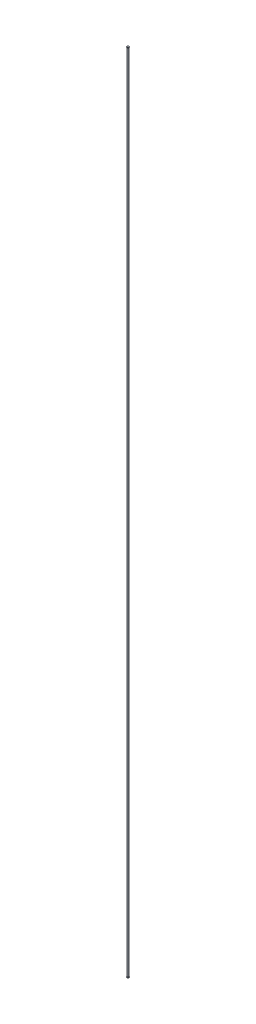
ISO-10303-21;
HEADER;
FILE_DESCRIPTION(('STEP AP214'),'2;1');
FILE_NAME('part.step','',(''),(''),'','','');
FILE_SCHEMA(('AUTOMOTIVE_DESIGN { 1 0 10303 214 1 1 1 1 }'));
ENDSEC;
DATA;
#1=APPLICATION_CONTEXT('core data for automotive mechanical design processes');
#2=APPLICATION_PROTOCOL_DEFINITION('international standard','automotive_design',2000,#1);
#3=PRODUCT_CONTEXT('',#1,'mechanical');
#4=PRODUCT('Part','Part','',(#3));
#5=PRODUCT_RELATED_PRODUCT_CATEGORY('part','',(#4));
#6=PRODUCT_DEFINITION_FORMATION('','',#4);
#7=PRODUCT_DEFINITION_CONTEXT('part definition',#1,'design');
#8=PRODUCT_DEFINITION('design','',#6,#7);
#9=PRODUCT_DEFINITION_SHAPE('','',#8);
#10=(LENGTH_UNIT() NAMED_UNIT(*) SI_UNIT(.MILLI.,.METRE.));
#11=(NAMED_UNIT(*) PLANE_ANGLE_UNIT() SI_UNIT($,.RADIAN.));
#12=(NAMED_UNIT(*) SI_UNIT($,.STERADIAN.) SOLID_ANGLE_UNIT());
#13=UNCERTAINTY_MEASURE_WITH_UNIT(LENGTH_MEASURE(1.E-05),#10,'distance_accuracy_value','');
#14=(GEOMETRIC_REPRESENTATION_CONTEXT(3) GLOBAL_UNCERTAINTY_ASSIGNED_CONTEXT((#13)) GLOBAL_UNIT_ASSIGNED_CONTEXT((#10,
#11,#12)) REPRESENTATION_CONTEXT('',''));
#15=CARTESIAN_POINT('',(0.,0.,0.));
#16=DIRECTION('',(0.,0.,1.));
#17=DIRECTION('',(1.,0.,0.));
#18=AXIS2_PLACEMENT_3D('',#15,#16,#17);
#19=CARTESIAN_POINT('',(0.,7781.036,0.));
#20=DIRECTION('',(0.,-1.,0.));
#21=DIRECTION('',(0.,0.,-1.));
#22=AXIS2_PLACEMENT_3D('',#19,#20,#21);
#23=CYLINDRICAL_SURFACE('',#22,6.35);
#24=CARTESIAN_POINT('',(0.,7781.036,0.));
#25=DIRECTION('',(0.,1.,0.));
#26=DIRECTION('',(0.,0.,1.));
#27=AXIS2_PLACEMENT_3D('',#24,#25,#26);
#28=CIRCLE('',#27,6.35);
#29=CARTESIAN_POINT('',(0.,7781.036,6.35));
#30=VERTEX_POINT('',#29);
#31=EDGE_CURVE('E10',#30,#30,#28,.T.);
#32=ORIENTED_EDGE('',*,*,#31,.F.);
#33=EDGE_LOOP('',(#32));
#34=FACE_BOUND('',#33,.T.);
#35=CARTESIAN_POINT('',(0.,0.,0.));
#36=DIRECTION('',(0.,1.,0.));
#37=DIRECTION('',(0.,0.,1.));
#38=AXIS2_PLACEMENT_3D('',#35,#36,#37);
#39=CIRCLE('',#38,6.35);
#40=CARTESIAN_POINT('',(0.,0.,6.35));
#41=VERTEX_POINT('',#40);
#42=EDGE_CURVE('E65',#41,#41,#39,.T.);
#43=ORIENTED_EDGE('',*,*,#42,.T.);
#44=EDGE_LOOP('',(#43));
#45=FACE_BOUND('',#44,.T.);
#46=ADVANCED_FACE('F37',(#34,#45),#23,.T.);
#47=CARTESIAN_POINT('',(0.,7781.036,0.));
#48=DIRECTION('',(0.,-1.,0.));
#49=DIRECTION('',(0.,0.,-1.));
#50=AXIS2_PLACEMENT_3D('',#47,#48,#49);
#51=CYLINDRICAL_SURFACE('',#50,3.175);
#52=CARTESIAN_POINT('',(0.,7781.036,0.));
#53=DIRECTION('',(0.,1.,0.));
#54=DIRECTION('',(0.,0.,1.));
#55=AXIS2_PLACEMENT_3D('',#52,#53,#54);
#56=CIRCLE('',#55,3.1750000000019);
#57=CARTESIAN_POINT('',(0.,7781.036,3.1750000000019));
#58=VERTEX_POINT('',#57);
#59=EDGE_CURVE('E47',#58,#58,#56,.T.);
#60=ORIENTED_EDGE('',*,*,#59,.T.);
#61=EDGE_LOOP('',(#60));
#62=FACE_BOUND('',#61,.T.);
#63=CARTESIAN_POINT('',(0.,0.,0.));
#64=DIRECTION('',(0.,1.,0.));
#65=DIRECTION('',(0.,0.,1.));
#66=AXIS2_PLACEMENT_3D('',#63,#64,#65);
#67=CIRCLE('',#66,3.175);
#68=CARTESIAN_POINT('',(0.,0.,3.175));
#69=VERTEX_POINT('',#68);
#70=EDGE_CURVE('E43',#69,#69,#67,.T.);
#71=ORIENTED_EDGE('',*,*,#70,.F.);
#72=EDGE_LOOP('',(#71));
#73=FACE_BOUND('',#72,.T.);
#74=ADVANCED_FACE('F82',(#62,#73),#51,.F.);
#75=CARTESIAN_POINT('',(0.,7787.46376452171,0.));
#76=DIRECTION('',(0.,1.,0.));
#77=DIRECTION('',(0.,0.,1.));
#78=AXIS2_PLACEMENT_3D('',#75,#76,#77);
#79=CONICAL_SURFACE('',#78,8.56853483946593,0.69813170079789);
#80=ORIENTED_EDGE('',*,*,#59,.F.);
#81=EDGE_LOOP('',(#80));
#82=FACE_BOUND('',#81,.T.);
#83=CARTESIAN_POINT('',(0.,7787.46376452171,0.));
#84=DIRECTION('',(0.,1.,0.));
#85=DIRECTION('',(0.,0.,1.));
#86=AXIS2_PLACEMENT_3D('',#83,#84,#85);
#87=CIRCLE('',#86,8.56853483946593);
#88=CARTESIAN_POINT('',(0.,7787.46376452171,8.56853483946593));
#89=VERTEX_POINT('',#88);
#90=EDGE_CURVE('E51',#89,#89,#87,.T.);
#91=ORIENTED_EDGE('',*,*,#90,.T.);
#92=EDGE_LOOP('',(#91));
#93=FACE_BOUND('',#92,.T.);
#94=ADVANCED_FACE('F87',(#82,#93),#79,.F.);
#95=CARTESIAN_POINT('',(0.,7785.9003822138,0.));
#96=DIRECTION('',(0.,-1.,0.));
#97=DIRECTION('',(0.,0.,-1.));
#98=AXIS2_PLACEMENT_3D('',#95,#96,#97);
#99=CONICAL_SURFACE('',#98,10.4317013215112,0.872664625996844);
#100=ORIENTED_EDGE('',*,*,#90,.F.);
#101=EDGE_LOOP('',(#100));
#102=FACE_BOUND('',#101,.T.);
#103=CARTESIAN_POINT('',(0.,7785.9003822138,0.));
#104=DIRECTION('',(0.,1.,0.));
#105=DIRECTION('',(0.,0.,1.));
#106=AXIS2_PLACEMENT_3D('',#103,#104,#105);
#107=CIRCLE('',#106,10.4317013215112);
#108=CARTESIAN_POINT('',(0.,7785.9003822138,10.4317013215112));
#109=VERTEX_POINT('',#108);
#110=EDGE_CURVE('E56',#109,#109,#107,.T.);
#111=ORIENTED_EDGE('',*,*,#110,.T.);
#112=EDGE_LOOP('',(#111));
#113=FACE_BOUND('',#112,.T.);
#114=ADVANCED_FACE('F92',(#102,#113),#99,.T.);
#115=CARTESIAN_POINT('',(0.,7781.036,0.));
#116=DIRECTION('',(0.,1.,0.));
#117=DIRECTION('',(0.,0.,1.));
#118=AXIS2_PLACEMENT_3D('',#115,#116,#117);
#119=CONICAL_SURFACE('',#118,6.35,0.698131700798075);
#120=ORIENTED_EDGE('',*,*,#110,.F.);
#121=EDGE_LOOP('',(#120));
#122=FACE_BOUND('',#121,.T.);
#123=ORIENTED_EDGE('',*,*,#31,.T.);
#124=EDGE_LOOP('',(#123));
#125=FACE_BOUND('',#124,.T.);
#126=ADVANCED_FACE('F99',(#122,#125),#119,.T.);
#127=CARTESIAN_POINT('',(0.,-6.42776452171123,0.));
#128=DIRECTION('',(0.,-1.,0.));
#129=DIRECTION('',(0.,0.,1.));
#130=AXIS2_PLACEMENT_3D('',#127,#128,#129);
#131=CONICAL_SURFACE('',#130,8.56853483946593,0.69813170079789);
#132=ORIENTED_EDGE('',*,*,#70,.T.);
#133=EDGE_LOOP('',(#132));
#134=FACE_BOUND('',#133,.T.);
#135=CARTESIAN_POINT('',(0.,-6.42776452171123,0.));
#136=DIRECTION('',(0.,1.,0.));
#137=DIRECTION('',(0.,0.,1.));
#138=AXIS2_PLACEMENT_3D('',#135,#136,#137);
#139=CIRCLE('',#138,8.56853483946593);
#140=CARTESIAN_POINT('',(0.,-6.42776452171123,8.56853483946593));
#141=VERTEX_POINT('',#140);
#142=EDGE_CURVE('E59',#141,#141,#139,.T.);
#143=ORIENTED_EDGE('',*,*,#142,.F.);
#144=EDGE_LOOP('',(#143));
#145=FACE_BOUND('',#144,.T.);
#146=ADVANCED_FACE('F78',(#134,#145),#131,.F.);
#147=CARTESIAN_POINT('',(0.,-4.86438221380414,0.));
#148=DIRECTION('',(0.,1.,0.));
#149=DIRECTION('',(0.,0.,-1.));
#150=AXIS2_PLACEMENT_3D('',#147,#148,#149);
#151=CONICAL_SURFACE('',#150,10.4317013215112,0.872664625996844);
#152=ORIENTED_EDGE('',*,*,#142,.T.);
#153=EDGE_LOOP('',(#152));
#154=FACE_BOUND('',#153,.T.);
#155=CARTESIAN_POINT('',(0.,-4.86438221380414,0.));
#156=DIRECTION('',(0.,1.,0.));
#157=DIRECTION('',(0.,0.,1.));
#158=AXIS2_PLACEMENT_3D('',#155,#156,#157);
#159=CIRCLE('',#158,10.4317013215112);
#160=CARTESIAN_POINT('',(0.,-4.86438221380414,10.4317013215112));
#161=VERTEX_POINT('',#160);
#162=EDGE_CURVE('E62',#161,#161,#159,.T.);
#163=ORIENTED_EDGE('',*,*,#162,.F.);
#164=EDGE_LOOP('',(#163));
#165=FACE_BOUND('',#164,.T.);
#166=ADVANCED_FACE('F72',(#154,#165),#151,.T.);
#167=CARTESIAN_POINT('',(0.,0.,0.));
#168=DIRECTION('',(0.,-1.,0.));
#169=DIRECTION('',(0.,0.,1.));
#170=AXIS2_PLACEMENT_3D('',#167,#168,#169);
#171=CONICAL_SURFACE('',#170,6.35,0.698131700798075);
#172=ORIENTED_EDGE('',*,*,#162,.T.);
#173=EDGE_LOOP('',(#172));
#174=FACE_BOUND('',#173,.T.);
#175=ORIENTED_EDGE('',*,*,#42,.F.);
#176=EDGE_LOOP('',(#175));
#177=FACE_BOUND('',#176,.T.);
#178=ADVANCED_FACE('F70',(#174,#177),#171,.T.);
#179=CLOSED_SHELL('',(#46,#74,#94,#114,#126,#146,#166,#178));
#180=MANIFOLD_SOLID_BREP('B2',#179);
#181=ADVANCED_BREP_SHAPE_REPRESENTATION('',(#18,#180),#14);
#182=SHAPE_DEFINITION_REPRESENTATION(#9,#181);
ENDSEC;
END-ISO-10303-21;
